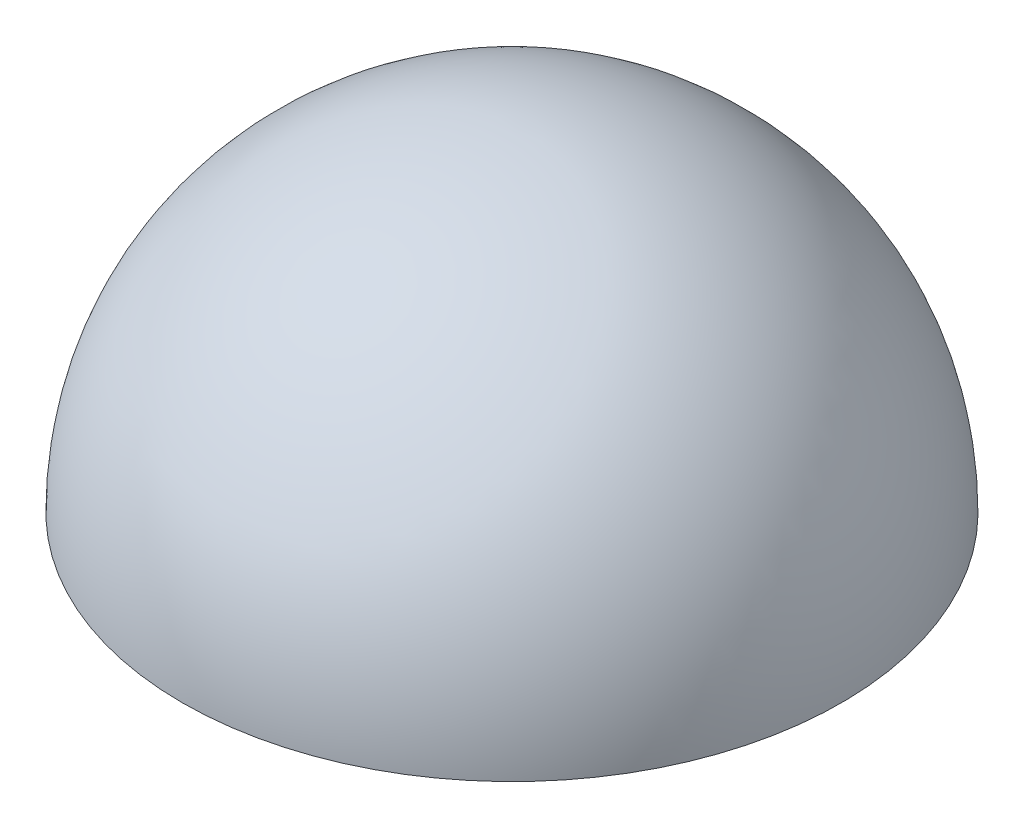
ISO-10303-21;
HEADER;
FILE_DESCRIPTION(('STEP AP214'),'2;1');
FILE_NAME('part.step','',(''),(''),'','','');
FILE_SCHEMA(('AUTOMOTIVE_DESIGN { 1 0 10303 214 1 1 1 1 }'));
ENDSEC;
DATA;
#1=APPLICATION_CONTEXT('core data for automotive mechanical design processes');
#2=APPLICATION_PROTOCOL_DEFINITION('international standard','automotive_design',2000,#1);
#3=PRODUCT_CONTEXT('',#1,'mechanical');
#4=PRODUCT('Part','Part','',(#3));
#5=PRODUCT_RELATED_PRODUCT_CATEGORY('part','',(#4));
#6=PRODUCT_DEFINITION_FORMATION('','',#4);
#7=PRODUCT_DEFINITION_CONTEXT('part definition',#1,'design');
#8=PRODUCT_DEFINITION('design','',#6,#7);
#9=PRODUCT_DEFINITION_SHAPE('','',#8);
#10=(LENGTH_UNIT() NAMED_UNIT(*) SI_UNIT(.MILLI.,.METRE.));
#11=(NAMED_UNIT(*) PLANE_ANGLE_UNIT() SI_UNIT($,.RADIAN.));
#12=(NAMED_UNIT(*) SI_UNIT($,.STERADIAN.) SOLID_ANGLE_UNIT());
#13=UNCERTAINTY_MEASURE_WITH_UNIT(LENGTH_MEASURE(1.E-05),#10,'distance_accuracy_value','');
#14=(GEOMETRIC_REPRESENTATION_CONTEXT(3) GLOBAL_UNCERTAINTY_ASSIGNED_CONTEXT((#13)) GLOBAL_UNIT_ASSIGNED_CONTEXT((#10,
#11,#12)) REPRESENTATION_CONTEXT('',''));
#15=CARTESIAN_POINT('',(0.,0.,0.));
#16=DIRECTION('',(0.,0.,1.));
#17=DIRECTION('',(1.,0.,0.));
#18=AXIS2_PLACEMENT_3D('',#15,#16,#17);
#19=CARTESIAN_POINT('',(0.,0.,0.));
#20=DIRECTION('',(0.,0.,1.));
#21=DIRECTION('',(1.,0.,0.));
#22=AXIS2_PLACEMENT_3D('',#19,#20,#21);
#23=SPHERICAL_SURFACE('',#22,19.05);
#24=CARTESIAN_POINT('',(0.,0.,0.));
#25=DIRECTION('',(0.,-1.,0.));
#26=DIRECTION('',(0.,0.,1.));
#27=AXIS2_PLACEMENT_3D('',#24,#25,#26);
#28=SPHERICAL_SURFACE('',#27,19.05);
#29=CARTESIAN_POINT('',(0.,0.,0.));
#30=DIRECTION('',(0.,-1.,0.));
#31=DIRECTION('',(0.,0.,1.));
#32=AXIS2_PLACEMENT_3D('',#29,#30,#31);
#33=CIRCLE('',#32,19.05);
#34=CARTESIAN_POINT('',(0.,0.,19.05));
#35=VERTEX_POINT('',#34);
#36=EDGE_CURVE('E10',#35,#35,#33,.T.);
#37=ORIENTED_EDGE('',*,*,#36,.F.);
#38=EDGE_LOOP('',(#37));
#39=FACE_BOUND('',#38,.T.);
#40=ADVANCED_FACE('F37',(#39),#28,.T.);
#41=CARTESIAN_POINT('',(0.,0.,0.));
#42=DIRECTION('',(0.,-1.,0.));
#43=DIRECTION('',(0.,0.,1.));
#44=AXIS2_PLACEMENT_3D('',#41,#42,#43);
#45=PLANE('',#44);
#46=CARTESIAN_POINT('',(0.,0.,0.));
#47=DIRECTION('',(0.,1.,0.));
#48=DIRECTION('',(1.,0.,0.));
#49=AXIS2_PLACEMENT_3D('',#46,#47,#48);
#50=CIRCLE('',#49,12.7);
#51=CARTESIAN_POINT('',(12.7,0.,0.));
#52=VERTEX_POINT('',#51);
#53=EDGE_CURVE('E44',#52,#52,#50,.T.);
#54=ORIENTED_EDGE('',*,*,#53,.T.);
#55=EDGE_LOOP('',(#54));
#56=FACE_BOUND('',#55,.T.);
#57=ORIENTED_EDGE('',*,*,#36,.T.);
#58=EDGE_LOOP('',(#57));
#59=FACE_BOUND('',#58,.T.);
#60=ADVANCED_FACE('F51',(#56,#59),#45,.T.);
#61=CARTESIAN_POINT('',(0.,0.,0.));
#62=DIRECTION('',(1.,0.,0.));
#63=DIRECTION('',(0.,0.,1.));
#64=AXIS2_PLACEMENT_3D('',#61,#62,#63);
#65=SPHERICAL_SURFACE('',#64,12.7);
#66=CARTESIAN_POINT('',(0.,0.,0.));
#67=DIRECTION('',(0.,1.,0.));
#68=DIRECTION('',(1.,0.,0.));
#69=AXIS2_PLACEMENT_3D('',#66,#67,#68);
#70=SPHERICAL_SURFACE('',#69,12.7);
#71=ORIENTED_EDGE('',*,*,#53,.F.);
#72=EDGE_LOOP('',(#71));
#73=FACE_BOUND('',#72,.T.);
#74=ADVANCED_FACE('F53',(#73),#70,.F.);
#75=CLOSED_SHELL('',(#40,#60,#74));
#76=MANIFOLD_SOLID_BREP('B2',#75);
#77=ADVANCED_BREP_SHAPE_REPRESENTATION('',(#18,#76),#14);
#78=SHAPE_DEFINITION_REPRESENTATION(#9,#77);
ENDSEC;
END-ISO-10303-21;
